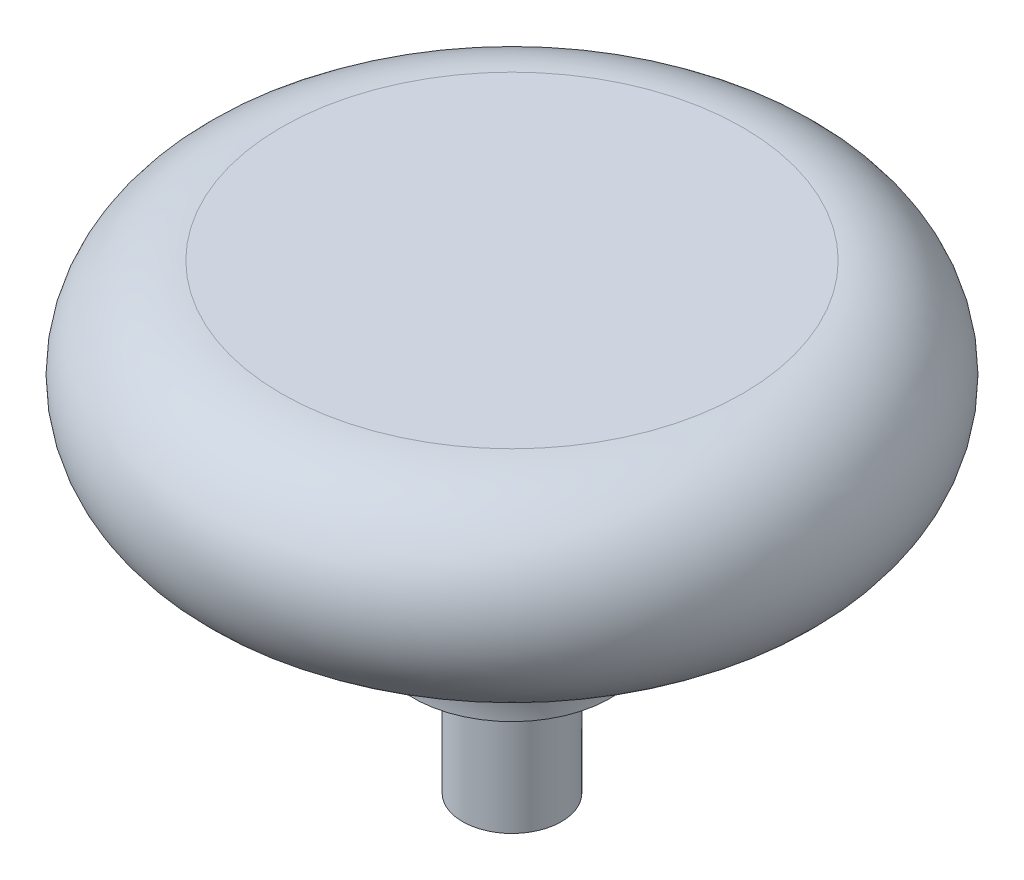
ISO-10303-21;
HEADER;
FILE_DESCRIPTION(('STEP AP214'),'2;1');
FILE_NAME('part.step','',(''),(''),'','','');
FILE_SCHEMA(('AUTOMOTIVE_DESIGN { 1 0 10303 214 1 1 1 1 }'));
ENDSEC;
DATA;
#1=APPLICATION_CONTEXT('core data for automotive mechanical design processes');
#2=APPLICATION_PROTOCOL_DEFINITION('international standard','automotive_design',2000,#1);
#3=PRODUCT_CONTEXT('',#1,'mechanical');
#4=PRODUCT('Part','Part','',(#3));
#5=PRODUCT_RELATED_PRODUCT_CATEGORY('part','',(#4));
#6=PRODUCT_DEFINITION_FORMATION('','',#4);
#7=PRODUCT_DEFINITION_CONTEXT('part definition',#1,'design');
#8=PRODUCT_DEFINITION('design','',#6,#7);
#9=PRODUCT_DEFINITION_SHAPE('','',#8);
#10=(LENGTH_UNIT() NAMED_UNIT(*) SI_UNIT(.MILLI.,.METRE.));
#11=(NAMED_UNIT(*) PLANE_ANGLE_UNIT() SI_UNIT($,.RADIAN.));
#12=(NAMED_UNIT(*) SI_UNIT($,.STERADIAN.) SOLID_ANGLE_UNIT());
#13=UNCERTAINTY_MEASURE_WITH_UNIT(LENGTH_MEASURE(1.E-05),#10,'distance_accuracy_value','');
#14=(GEOMETRIC_REPRESENTATION_CONTEXT(3) GLOBAL_UNCERTAINTY_ASSIGNED_CONTEXT((#13)) GLOBAL_UNIT_ASSIGNED_CONTEXT((#10,
#11,#12)) REPRESENTATION_CONTEXT('',''));
#15=CARTESIAN_POINT('',(0.,0.,0.));
#16=DIRECTION('',(0.,0.,1.));
#17=DIRECTION('',(1.,0.,0.));
#18=AXIS2_PLACEMENT_3D('',#15,#16,#17);
#19=CARTESIAN_POINT('',(2.38125,0.,0.));
#20=DIRECTION('',(0.,1.,0.));
#21=DIRECTION('',(0.,0.,1.));
#22=AXIS2_PLACEMENT_3D('',#19,#20,#21);
#23=PLANE('',#22);
#24=CARTESIAN_POINT('',(0.,0.,0.));
#25=DIRECTION('',(0.,-1.,0.));
#26=DIRECTION('',(0.,0.,-1.));
#27=AXIS2_PLACEMENT_3D('',#24,#25,#26);
#28=CIRCLE('',#27,2.38125);
#29=CARTESIAN_POINT('',(0.,0.,-2.38125));
#30=VERTEX_POINT('',#29);
#31=EDGE_CURVE('E62',#30,#30,#28,.T.);
#32=ORIENTED_EDGE('',*,*,#31,.T.);
#33=EDGE_LOOP('',(#32));
#34=FACE_BOUND('',#33,.T.);
#35=ADVANCED_FACE('F43',(#34),#23,.F.);
#36=CARTESIAN_POINT('',(0.,22.225,0.));
#37=DIRECTION('',(0.,-1.,0.));
#38=DIRECTION('',(0.,0.,-1.));
#39=AXIS2_PLACEMENT_3D('',#36,#37,#38);
#40=PLANE('',#39);
#41=CARTESIAN_POINT('',(0.,22.225,0.));
#42=DIRECTION('',(0.,-1.,0.));
#43=DIRECTION('',(0.,0.,-1.));
#44=AXIS2_PLACEMENT_3D('',#41,#42,#43);
#45=CIRCLE('',#44,11.1125);
#46=CARTESIAN_POINT('',(0.,22.225,-11.1125));
#47=VERTEX_POINT('',#46);
#48=EDGE_CURVE('E12',#47,#47,#45,.T.);
#49=ORIENTED_EDGE('',*,*,#48,.F.);
#50=EDGE_LOOP('',(#49));
#51=FACE_BOUND('',#50,.T.);
#52=ADVANCED_FACE('F86',(#51),#40,.F.);
#53=CARTESIAN_POINT('',(0.,17.4625,0.));
#54=DIRECTION('',(0.,-1.,0.));
#55=DIRECTION('',(0.,0.,-1.));
#56=AXIS2_PLACEMENT_3D('',#53,#54,#55);
#57=TOROIDAL_SURFACE('',#56,11.1125,4.7625);
#58=CARTESIAN_POINT('',(0.,12.7,0.));
#59=DIRECTION('',(0.,-1.,0.));
#60=DIRECTION('',(0.,0.,-1.));
#61=AXIS2_PLACEMENT_3D('',#58,#59,#60);
#62=CIRCLE('',#61,11.1125);
#63=CARTESIAN_POINT('',(0.,12.7,-11.1125));
#64=VERTEX_POINT('',#63);
#65=EDGE_CURVE('E49',#64,#64,#62,.T.);
#66=ORIENTED_EDGE('',*,*,#65,.F.);
#67=EDGE_LOOP('',(#66));
#68=FACE_BOUND('',#67,.T.);
#69=ORIENTED_EDGE('',*,*,#48,.T.);
#70=EDGE_LOOP('',(#69));
#71=FACE_BOUND('',#70,.T.);
#72=ADVANCED_FACE('F81',(#68,#71),#57,.T.);
#73=CARTESIAN_POINT('',(0.,6.35,0.));
#74=DIRECTION('',(0.,-1.,0.));
#75=DIRECTION('',(0.,0.,-1.));
#76=AXIS2_PLACEMENT_3D('',#73,#74,#75);
#77=TOROIDAL_SURFACE('',#76,11.1125,6.35);
#78=CARTESIAN_POINT('',(0.,6.35,0.));
#79=DIRECTION('',(0.,-1.,0.));
#80=DIRECTION('',(0.,0.,-1.));
#81=AXIS2_PLACEMENT_3D('',#78,#79,#80);
#82=CIRCLE('',#81,4.7625);
#83=CARTESIAN_POINT('',(0.,6.35,-4.7625));
#84=VERTEX_POINT('',#83);
#85=EDGE_CURVE('E53',#84,#84,#82,.T.);
#86=ORIENTED_EDGE('',*,*,#85,.F.);
#87=EDGE_LOOP('',(#86));
#88=FACE_BOUND('',#87,.T.);
#89=ORIENTED_EDGE('',*,*,#65,.T.);
#90=EDGE_LOOP('',(#89));
#91=FACE_BOUND('',#90,.T.);
#92=ADVANCED_FACE('F76',(#88,#91),#77,.F.);
#93=CARTESIAN_POINT('',(4.7625,6.35,0.));
#94=DIRECTION('',(0.,1.,0.));
#95=DIRECTION('',(0.,0.,1.));
#96=AXIS2_PLACEMENT_3D('',#93,#94,#95);
#97=PLANE('',#96);
#98=CARTESIAN_POINT('',(0.,6.35,0.));
#99=DIRECTION('',(0.,-1.,0.));
#100=DIRECTION('',(0.,0.,-1.));
#101=AXIS2_PLACEMENT_3D('',#98,#99,#100);
#102=CIRCLE('',#101,2.38125);
#103=CARTESIAN_POINT('',(0.,6.35,-2.38125));
#104=VERTEX_POINT('',#103);
#105=EDGE_CURVE('E57',#104,#104,#102,.T.);
#106=ORIENTED_EDGE('',*,*,#105,.F.);
#107=EDGE_LOOP('',(#106));
#108=FACE_BOUND('',#107,.T.);
#109=ORIENTED_EDGE('',*,*,#85,.T.);
#110=EDGE_LOOP('',(#109));
#111=FACE_BOUND('',#110,.T.);
#112=ADVANCED_FACE('F70',(#108,#111),#97,.F.);
#113=CARTESIAN_POINT('',(0.,0.,0.));
#114=DIRECTION('',(0.,-1.,0.));
#115=DIRECTION('',(0.,0.,-1.));
#116=AXIS2_PLACEMENT_3D('',#113,#114,#115);
#117=CYLINDRICAL_SURFACE('',#116,2.38125);
#118=ORIENTED_EDGE('',*,*,#31,.F.);
#119=EDGE_LOOP('',(#118));
#120=FACE_BOUND('',#119,.T.);
#121=ORIENTED_EDGE('',*,*,#105,.T.);
#122=EDGE_LOOP('',(#121));
#123=FACE_BOUND('',#122,.T.);
#124=ADVANCED_FACE('F67',(#120,#123),#117,.T.);
#125=CLOSED_SHELL('',(#35,#52,#72,#92,#112,#124));
#126=MANIFOLD_SOLID_BREP('B2',#125);
#127=ADVANCED_BREP_SHAPE_REPRESENTATION('',(#18,#126),#14);
#128=SHAPE_DEFINITION_REPRESENTATION(#9,#127);
ENDSEC;
END-ISO-10303-21;
